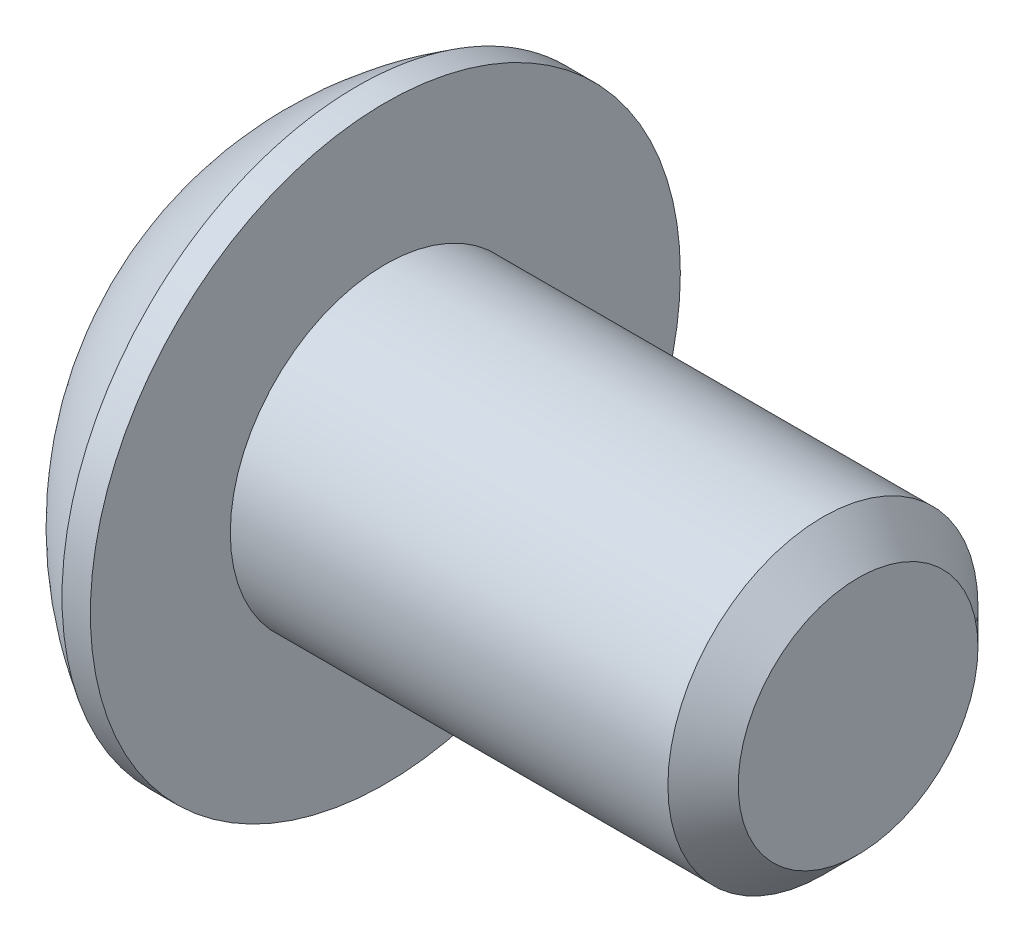
ISO-10303-21;
HEADER;
FILE_DESCRIPTION(('STEP AP214'),'2;1');
FILE_NAME('part.step','',(''),(''),'','','');
FILE_SCHEMA(('AUTOMOTIVE_DESIGN { 1 0 10303 214 1 1 1 1 }'));
ENDSEC;
DATA;
#1=APPLICATION_CONTEXT('core data for automotive mechanical design processes');
#2=APPLICATION_PROTOCOL_DEFINITION('international standard','automotive_design',2000,#1);
#3=PRODUCT_CONTEXT('',#1,'mechanical');
#4=PRODUCT('Part','Part','',(#3));
#5=PRODUCT_RELATED_PRODUCT_CATEGORY('part','',(#4));
#6=PRODUCT_DEFINITION_FORMATION('','',#4);
#7=PRODUCT_DEFINITION_CONTEXT('part definition',#1,'design');
#8=PRODUCT_DEFINITION('design','',#6,#7);
#9=PRODUCT_DEFINITION_SHAPE('','',#8);
#10=(LENGTH_UNIT() NAMED_UNIT(*) SI_UNIT(.MILLI.,.METRE.));
#11=(NAMED_UNIT(*) PLANE_ANGLE_UNIT() SI_UNIT($,.RADIAN.));
#12=(NAMED_UNIT(*) SI_UNIT($,.STERADIAN.) SOLID_ANGLE_UNIT());
#13=UNCERTAINTY_MEASURE_WITH_UNIT(LENGTH_MEASURE(1.E-05),#10,'distance_accuracy_value','');
#14=(GEOMETRIC_REPRESENTATION_CONTEXT(3) GLOBAL_UNCERTAINTY_ASSIGNED_CONTEXT((#13)) GLOBAL_UNIT_ASSIGNED_CONTEXT((#10,
#11,#12)) REPRESENTATION_CONTEXT('',''));
#15=CARTESIAN_POINT('',(0.,0.,0.));
#16=DIRECTION('',(0.,0.,1.));
#17=DIRECTION('',(1.,0.,0.));
#18=AXIS2_PLACEMENT_3D('',#15,#16,#17);
#19=CARTESIAN_POINT('',(1.32080000000034,0.,0.));
#20=DIRECTION('',(-1.,0.,0.));
#21=DIRECTION('',(0.,0.,-1.));
#22=AXIS2_PLACEMENT_3D('',#19,#20,#21);
#23=CONICAL_SURFACE('',#22,1.1937999999998,1.04719755119608);
#24=CARTESIAN_POINT('',(2.01004075135902,0.,-4.44089209850063E-13));
#25=VERTEX_POINT('',#24);
#26=VERTEX_LOOP('',#25);
#27=FACE_BOUND('',#26,.T.);
#28=CARTESIAN_POINT('',(1.32080000000009,0.,0.));
#29=DIRECTION('',(1.,0.,0.));
#30=DIRECTION('',(0.,0.,-1.));
#31=AXIS2_PLACEMENT_3D('',#28,#29,#30);
#32=CIRCLE('',#31,1.19380000000024);
#33=CARTESIAN_POINT('',(1.32080000000004,-1.03386112703797,-0.59690000000006));
#34=VERTEX_POINT('',#33);
#35=CARTESIAN_POINT('',(1.32080000000004,0.,-1.19380000000012));
#36=VERTEX_POINT('',#35);
#37=EDGE_CURVE('E37',#34,#36,#32,.T.);
#38=ORIENTED_EDGE('',*,*,#37,.F.);
#39=CARTESIAN_POINT('',(1.32080000000009,0.,0.));
#40=DIRECTION('',(1.,0.,0.));
#41=DIRECTION('',(0.,0.,-1.));
#42=AXIS2_PLACEMENT_3D('',#39,#40,#41);
#43=CIRCLE('',#42,1.19380000000024);
#44=CARTESIAN_POINT('',(1.32080000000004,-1.03386112703797,0.59690000000006));
#45=VERTEX_POINT('',#44);
#46=EDGE_CURVE('E127',#45,#34,#43,.T.);
#47=ORIENTED_EDGE('',*,*,#46,.F.);
#48=CARTESIAN_POINT('',(1.32080000000009,0.,0.));
#49=DIRECTION('',(1.,0.,0.));
#50=DIRECTION('',(0.,0.,-1.));
#51=AXIS2_PLACEMENT_3D('',#48,#49,#50);
#52=CIRCLE('',#51,1.19380000000024);
#53=CARTESIAN_POINT('',(1.32080000000004,1.49457637585666E-12,1.19380000000012));
#54=VERTEX_POINT('',#53);
#55=EDGE_CURVE('E133',#54,#45,#52,.T.);
#56=ORIENTED_EDGE('',*,*,#55,.F.);
#57=CARTESIAN_POINT('',(1.32080000000009,0.,0.));
#58=DIRECTION('',(1.,0.,0.));
#59=DIRECTION('',(0.,0.,-1.));
#60=AXIS2_PLACEMENT_3D('',#57,#58,#59);
#61=CIRCLE('',#60,1.19380000000024);
#62=CARTESIAN_POINT('',(1.32080000000004,1.03386112703797,0.596900000000061));
#63=VERTEX_POINT('',#62);
#64=EDGE_CURVE('E147',#63,#54,#61,.T.);
#65=ORIENTED_EDGE('',*,*,#64,.F.);
#66=CARTESIAN_POINT('',(1.32080000000009,0.,0.));
#67=DIRECTION('',(1.,0.,0.));
#68=DIRECTION('',(0.,0.,-1.));
#69=AXIS2_PLACEMENT_3D('',#66,#67,#68);
#70=CIRCLE('',#69,1.19380000000024);
#71=CARTESIAN_POINT('',(1.32080000000004,1.03386112703797,-0.596900000000061));
#72=VERTEX_POINT('',#71);
#73=EDGE_CURVE('E140',#72,#63,#70,.T.);
#74=ORIENTED_EDGE('',*,*,#73,.F.);
#75=CARTESIAN_POINT('',(1.32080000000009,0.,0.));
#76=DIRECTION('',(1.,0.,0.));
#77=DIRECTION('',(0.,0.,-1.));
#78=AXIS2_PLACEMENT_3D('',#75,#76,#77);
#79=CIRCLE('',#78,1.19380000000024);
#80=EDGE_CURVE('E137',#36,#72,#79,.T.);
#81=ORIENTED_EDGE('',*,*,#80,.F.);
#82=EDGE_LOOP('',(#38,#47,#56,#65,#74,#81));
#83=FACE_BOUND('',#82,.T.);
#84=ADVANCED_FACE('F34',(#27,#83),#23,.F.);
#85=CARTESIAN_POINT('',(1.3208,-2.06772225407572,1.1938));
#86=DIRECTION('',(1.,0.,0.));
#87=DIRECTION('',(0.,0.,1.));
#88=AXIS2_PLACEMENT_3D('',#85,#86,#87);
#89=PLANE('',#88);
#90=DIRECTION('',(0.,0.5,-0.866025403784439));
#91=VECTOR('',#90,1.);
#92=CARTESIAN_POINT('',(1.3208,-1.37848150271715,0.));
#93=LINE('',#92,#91);
#94=CARTESIAN_POINT('',(1.3208,-0.689240751358574,-1.1938));
#95=VERTEX_POINT('',#94);
#96=EDGE_CURVE('E109',#95,#34,#93,.F.);
#97=ORIENTED_EDGE('',*,*,#96,.T.);
#98=ORIENTED_EDGE('',*,*,#37,.T.);
#99=DIRECTION('',(0.,1.,0.));
#100=VECTOR('',#99,1.);
#101=CARTESIAN_POINT('',(1.3208,-0.689240751358574,-1.1938));
#102=LINE('',#101,#100);
#103=EDGE_CURVE('E124',#36,#95,#102,.F.);
#104=ORIENTED_EDGE('',*,*,#103,.T.);
#105=EDGE_LOOP('',(#97,#98,#104));
#106=FACE_BOUND('',#105,.T.);
#107=ADVANCED_FACE('F121',(#106),#89,.F.);
#108=CARTESIAN_POINT('',(1.3208,-2.06772225407572,1.1938));
#109=DIRECTION('',(1.,0.,0.));
#110=DIRECTION('',(0.,0.,1.));
#111=AXIS2_PLACEMENT_3D('',#108,#109,#110);
#112=PLANE('',#111);
#113=DIRECTION('',(0.,-0.5,-0.866025403784439));
#114=VECTOR('',#113,1.);
#115=CARTESIAN_POINT('',(1.3208,-0.689240751358574,1.1938));
#116=LINE('',#115,#114);
#117=CARTESIAN_POINT('',(1.3208,-1.37848150271715,0.));
#118=VERTEX_POINT('',#117);
#119=EDGE_CURVE('E129',#118,#45,#116,.F.);
#120=ORIENTED_EDGE('',*,*,#119,.T.);
#121=ORIENTED_EDGE('',*,*,#46,.T.);
#122=DIRECTION('',(0.,0.5,-0.866025403784439));
#123=VECTOR('',#122,1.);
#124=CARTESIAN_POINT('',(1.3208,-1.37848150271715,0.));
#125=LINE('',#124,#123);
#126=EDGE_CURVE('E104',#34,#118,#125,.F.);
#127=ORIENTED_EDGE('',*,*,#126,.T.);
#128=EDGE_LOOP('',(#120,#121,#127));
#129=FACE_BOUND('',#128,.T.);
#130=ADVANCED_FACE('F128',(#129),#112,.F.);
#131=CARTESIAN_POINT('',(1.3208,-2.06772225407572,1.1938));
#132=DIRECTION('',(1.,0.,0.));
#133=DIRECTION('',(0.,0.,1.));
#134=AXIS2_PLACEMENT_3D('',#131,#132,#133);
#135=PLANE('',#134);
#136=DIRECTION('',(0.,1.,0.));
#137=VECTOR('',#136,1.);
#138=CARTESIAN_POINT('',(1.3208,0.689240751358577,1.1938));
#139=LINE('',#138,#137);
#140=CARTESIAN_POINT('',(1.3208,-0.689240751358574,1.1938));
#141=VERTEX_POINT('',#140);
#142=EDGE_CURVE('E166',#141,#54,#139,.T.);
#143=ORIENTED_EDGE('',*,*,#142,.T.);
#144=ORIENTED_EDGE('',*,*,#55,.T.);
#145=DIRECTION('',(0.,-0.5,-0.866025403784439));
#146=VECTOR('',#145,1.);
#147=CARTESIAN_POINT('',(1.3208,-0.689240751358574,1.1938));
#148=LINE('',#147,#146);
#149=EDGE_CURVE('E164',#45,#141,#148,.F.);
#150=ORIENTED_EDGE('',*,*,#149,.T.);
#151=EDGE_LOOP('',(#143,#144,#150));
#152=FACE_BOUND('',#151,.T.);
#153=ADVANCED_FACE('F163',(#152),#135,.F.);
#154=CARTESIAN_POINT('',(1.3208,-2.06772225407572,1.1938));
#155=DIRECTION('',(1.,0.,0.));
#156=DIRECTION('',(0.,0.,1.));
#157=AXIS2_PLACEMENT_3D('',#154,#155,#156);
#158=PLANE('',#157);
#159=DIRECTION('',(0.,-0.5,0.866025403784439));
#160=VECTOR('',#159,1.);
#161=CARTESIAN_POINT('',(1.3208,1.37848150271715,0.));
#162=LINE('',#161,#160);
#163=CARTESIAN_POINT('',(1.3208,0.689240751358577,1.1938));
#164=VERTEX_POINT('',#163);
#165=EDGE_CURVE('E173',#164,#63,#162,.F.);
#166=ORIENTED_EDGE('',*,*,#165,.T.);
#167=ORIENTED_EDGE('',*,*,#64,.T.);
#168=DIRECTION('',(0.,1.,0.));
#169=VECTOR('',#168,1.);
#170=CARTESIAN_POINT('',(1.3208,0.689240751358577,1.1938));
#171=LINE('',#170,#169);
#172=EDGE_CURVE('E171',#54,#164,#171,.T.);
#173=ORIENTED_EDGE('',*,*,#172,.T.);
#174=EDGE_LOOP('',(#166,#167,#173));
#175=FACE_BOUND('',#174,.T.);
#176=ADVANCED_FACE('F170',(#175),#158,.F.);
#177=CARTESIAN_POINT('',(1.3208,-2.06772225407572,1.1938));
#178=DIRECTION('',(1.,0.,0.));
#179=DIRECTION('',(0.,0.,1.));
#180=AXIS2_PLACEMENT_3D('',#177,#178,#179);
#181=PLANE('',#180);
#182=DIRECTION('',(0.,0.5,0.866025403784439));
#183=VECTOR('',#182,1.);
#184=CARTESIAN_POINT('',(1.3208,0.689240751358576,-1.1938));
#185=LINE('',#184,#183);
#186=CARTESIAN_POINT('',(1.3208,1.37848150271715,0.));
#187=VERTEX_POINT('',#186);
#188=EDGE_CURVE('E184',#187,#72,#185,.F.);
#189=ORIENTED_EDGE('',*,*,#188,.T.);
#190=ORIENTED_EDGE('',*,*,#73,.T.);
#191=DIRECTION('',(0.,-0.5,0.866025403784439));
#192=VECTOR('',#191,1.);
#193=CARTESIAN_POINT('',(1.3208,1.37848150271715,0.));
#194=LINE('',#193,#192);
#195=EDGE_CURVE('E176',#63,#187,#194,.F.);
#196=ORIENTED_EDGE('',*,*,#195,.T.);
#197=EDGE_LOOP('',(#189,#190,#196));
#198=FACE_BOUND('',#197,.T.);
#199=ADVANCED_FACE('F182',(#198),#181,.F.);
#200=CARTESIAN_POINT('',(1.3208,-2.06772225407572,1.1938));
#201=DIRECTION('',(1.,0.,0.));
#202=DIRECTION('',(0.,0.,1.));
#203=AXIS2_PLACEMENT_3D('',#200,#201,#202);
#204=PLANE('',#203);
#205=DIRECTION('',(0.,1.,0.));
#206=VECTOR('',#205,1.);
#207=CARTESIAN_POINT('',(1.3208,-0.689240751358574,-1.1938));
#208=LINE('',#207,#206);
#209=CARTESIAN_POINT('',(1.3208,0.689240751358576,-1.1938));
#210=VERTEX_POINT('',#209);
#211=EDGE_CURVE('E144',#210,#36,#208,.F.);
#212=ORIENTED_EDGE('',*,*,#211,.T.);
#213=ORIENTED_EDGE('',*,*,#80,.T.);
#214=DIRECTION('',(0.,0.5,0.866025403784439));
#215=VECTOR('',#214,1.);
#216=CARTESIAN_POINT('',(1.3208,0.689240751358576,-1.1938));
#217=LINE('',#216,#215);
#218=EDGE_CURVE('E186',#72,#210,#217,.F.);
#219=ORIENTED_EDGE('',*,*,#218,.T.);
#220=EDGE_LOOP('',(#212,#213,#219));
#221=FACE_BOUND('',#220,.T.);
#222=ADVANCED_FACE('F307',(#221),#204,.F.);
#223=CARTESIAN_POINT('',(1.3208,-0.689240751358574,-1.1938));
#224=DIRECTION('',(0.,0.,1.));
#225=DIRECTION('',(0.,1.,0.));
#226=AXIS2_PLACEMENT_3D('',#223,#224,#225);
#227=PLANE('',#226);
#228=DIRECTION('',(0.,1.,0.));
#229=VECTOR('',#228,1.);
#230=CARTESIAN_POINT('',(0.,0.,-1.1938));
#231=LINE('',#230,#229);
#232=CARTESIAN_POINT('',(0.,0.689240751358577,-1.1938));
#233=VERTEX_POINT('',#232);
#234=CARTESIAN_POINT('',(0.,-0.689240751358574,-1.1938));
#235=VERTEX_POINT('',#234);
#236=EDGE_CURVE('E194',#233,#235,#231,.F.);
#237=ORIENTED_EDGE('',*,*,#236,.T.);
#238=DIRECTION('',(1.,0.,0.));
#239=VECTOR('',#238,1.);
#240=CARTESIAN_POINT('',(1.3208,-0.689240751358574,-1.1938));
#241=LINE('',#240,#239);
#242=EDGE_CURVE('E116',#235,#95,#241,.T.);
#243=ORIENTED_EDGE('',*,*,#242,.T.);
#244=ORIENTED_EDGE('',*,*,#103,.F.);
#245=ORIENTED_EDGE('',*,*,#211,.F.);
#246=DIRECTION('',(1.,0.,0.));
#247=VECTOR('',#246,1.);
#248=CARTESIAN_POINT('',(1.3208,0.689240751358576,-1.1938));
#249=LINE('',#248,#247);
#250=EDGE_CURVE('E189',#210,#233,#249,.F.);
#251=ORIENTED_EDGE('',*,*,#250,.T.);
#252=EDGE_LOOP('',(#237,#243,#244,#245,#251));
#253=FACE_BOUND('',#252,.T.);
#254=ADVANCED_FACE('F273',(#253),#227,.T.);
#255=CARTESIAN_POINT('',(1.3208,-1.37848150271715,0.));
#256=DIRECTION('',(0.,0.866025403784439,0.5));
#257=DIRECTION('',(0.,0.5,-0.866025403784439));
#258=AXIS2_PLACEMENT_3D('',#255,#256,#257);
#259=PLANE('',#258);
#260=DIRECTION('',(0.,-0.5,0.866025403784439));
#261=VECTOR('',#260,1.);
#262=CARTESIAN_POINT('',(0.,-0.689240751358574,-1.1938));
#263=LINE('',#262,#261);
#264=CARTESIAN_POINT('',(0.,-1.37848150271715,0.));
#265=VERTEX_POINT('',#264);
#266=EDGE_CURVE('E270',#235,#265,#263,.T.);
#267=ORIENTED_EDGE('',*,*,#266,.T.);
#268=DIRECTION('',(1.,0.,0.));
#269=VECTOR('',#268,1.);
#270=CARTESIAN_POINT('',(1.3208,-1.37848150271715,0.));
#271=LINE('',#270,#269);
#272=EDGE_CURVE('E111',#265,#118,#271,.T.);
#273=ORIENTED_EDGE('',*,*,#272,.T.);
#274=ORIENTED_EDGE('',*,*,#126,.F.);
#275=ORIENTED_EDGE('',*,*,#96,.F.);
#276=ORIENTED_EDGE('',*,*,#242,.F.);
#277=EDGE_LOOP('',(#267,#273,#274,#275,#276));
#278=FACE_BOUND('',#277,.T.);
#279=ADVANCED_FACE('F107',(#278),#259,.T.);
#280=CARTESIAN_POINT('',(1.3208,-0.689240751358574,1.1938));
#281=DIRECTION('',(0.,0.866025403784439,-0.5));
#282=DIRECTION('',(0.,-0.5,-0.866025403784439));
#283=AXIS2_PLACEMENT_3D('',#280,#281,#282);
#284=PLANE('',#283);
#285=DIRECTION('',(0.,0.5,0.866025403784439));
#286=VECTOR('',#285,1.);
#287=CARTESIAN_POINT('',(0.,-1.37848150271715,0.));
#288=LINE('',#287,#286);
#289=CARTESIAN_POINT('',(0.,-0.689240751358574,1.1938));
#290=VERTEX_POINT('',#289);
#291=EDGE_CURVE('E268',#265,#290,#288,.T.);
#292=ORIENTED_EDGE('',*,*,#291,.T.);
#293=DIRECTION('',(1.,0.,0.));
#294=VECTOR('',#293,1.);
#295=CARTESIAN_POINT('',(1.3208,-0.689240751358574,1.1938));
#296=LINE('',#295,#294);
#297=EDGE_CURVE('E177',#290,#141,#296,.T.);
#298=ORIENTED_EDGE('',*,*,#297,.T.);
#299=ORIENTED_EDGE('',*,*,#149,.F.);
#300=ORIENTED_EDGE('',*,*,#119,.F.);
#301=ORIENTED_EDGE('',*,*,#272,.F.);
#302=EDGE_LOOP('',(#292,#298,#299,#300,#301));
#303=FACE_BOUND('',#302,.T.);
#304=ADVANCED_FACE('F278',(#303),#284,.T.);
#305=CARTESIAN_POINT('',(1.3208,0.689240751358577,1.1938));
#306=DIRECTION('',(0.,0.,-1.));
#307=DIRECTION('',(1.,0.,0.));
#308=AXIS2_PLACEMENT_3D('',#305,#306,#307);
#309=PLANE('',#308);
#310=DIRECTION('',(0.,1.,0.));
#311=VECTOR('',#310,1.);
#312=CARTESIAN_POINT('',(0.,0.,1.1938));
#313=LINE('',#312,#311);
#314=CARTESIAN_POINT('',(0.,0.689240751358577,1.1938));
#315=VERTEX_POINT('',#314);
#316=EDGE_CURVE('E260',#290,#315,#313,.T.);
#317=ORIENTED_EDGE('',*,*,#316,.T.);
#318=DIRECTION('',(1.,0.,0.));
#319=VECTOR('',#318,1.);
#320=CARTESIAN_POINT('',(1.3208,0.689240751358577,1.1938));
#321=LINE('',#320,#319);
#322=EDGE_CURVE('E187',#315,#164,#321,.T.);
#323=ORIENTED_EDGE('',*,*,#322,.T.);
#324=ORIENTED_EDGE('',*,*,#172,.F.);
#325=ORIENTED_EDGE('',*,*,#142,.F.);
#326=ORIENTED_EDGE('',*,*,#297,.F.);
#327=EDGE_LOOP('',(#317,#323,#324,#325,#326));
#328=FACE_BOUND('',#327,.T.);
#329=ADVANCED_FACE('F280',(#328),#309,.T.);
#330=CARTESIAN_POINT('',(1.3208,1.37848150271715,0.));
#331=DIRECTION('',(0.,-0.866025403784439,-0.5));
#332=DIRECTION('',(0.,-0.5,0.866025403784439));
#333=AXIS2_PLACEMENT_3D('',#330,#331,#332);
#334=PLANE('',#333);
#335=DIRECTION('',(0.,0.5,-0.866025403784439));
#336=VECTOR('',#335,1.);
#337=CARTESIAN_POINT('',(0.,0.689240751358577,1.1938));
#338=LINE('',#337,#336);
#339=CARTESIAN_POINT('',(0.,1.37848150271715,0.));
#340=VERTEX_POINT('',#339);
#341=EDGE_CURVE('E257',#315,#340,#338,.T.);
#342=ORIENTED_EDGE('',*,*,#341,.T.);
#343=DIRECTION('',(1.,0.,0.));
#344=VECTOR('',#343,1.);
#345=CARTESIAN_POINT('',(1.3208,1.37848150271715,0.));
#346=LINE('',#345,#344);
#347=EDGE_CURVE('E202',#340,#187,#346,.T.);
#348=ORIENTED_EDGE('',*,*,#347,.T.);
#349=ORIENTED_EDGE('',*,*,#195,.F.);
#350=ORIENTED_EDGE('',*,*,#165,.F.);
#351=ORIENTED_EDGE('',*,*,#322,.F.);
#352=EDGE_LOOP('',(#342,#348,#349,#350,#351));
#353=FACE_BOUND('',#352,.T.);
#354=ADVANCED_FACE('F281',(#353),#334,.T.);
#355=CARTESIAN_POINT('',(1.3208,0.689240751358576,-1.1938));
#356=DIRECTION('',(0.,-0.866025403784439,0.5));
#357=DIRECTION('',(0.,0.5,0.866025403784439));
#358=AXIS2_PLACEMENT_3D('',#355,#356,#357);
#359=PLANE('',#358);
#360=DIRECTION('',(0.,-0.5,-0.866025403784439));
#361=VECTOR('',#360,1.);
#362=CARTESIAN_POINT('',(0.,1.37848150271715,0.));
#363=LINE('',#362,#361);
#364=EDGE_CURVE('E52',#340,#233,#363,.T.);
#365=ORIENTED_EDGE('',*,*,#364,.T.);
#366=ORIENTED_EDGE('',*,*,#250,.F.);
#367=ORIENTED_EDGE('',*,*,#218,.F.);
#368=ORIENTED_EDGE('',*,*,#188,.F.);
#369=ORIENTED_EDGE('',*,*,#347,.F.);
#370=EDGE_LOOP('',(#365,#366,#367,#368,#369));
#371=FACE_BOUND('',#370,.T.);
#372=ADVANCED_FACE('F282',(#371),#359,.T.);
#373=CARTESIAN_POINT('',(0.,0.,0.));
#374=DIRECTION('',(-1.,0.,0.));
#375=DIRECTION('',(0.,0.,-1.));
#376=AXIS2_PLACEMENT_3D('',#373,#374,#375);
#377=PLANE('',#376);
#378=ORIENTED_EDGE('',*,*,#341,.F.);
#379=ORIENTED_EDGE('',*,*,#316,.F.);
#380=ORIENTED_EDGE('',*,*,#291,.F.);
#381=ORIENTED_EDGE('',*,*,#266,.F.);
#382=ORIENTED_EDGE('',*,*,#236,.F.);
#383=ORIENTED_EDGE('',*,*,#364,.F.);
#384=EDGE_LOOP('',(#378,#379,#380,#381,#382,#383));
#385=FACE_BOUND('',#384,.T.);
#386=CARTESIAN_POINT('',(0.,1.9812,0.));
#387=CARTESIAN_POINT('',(0.,1.9811996664299,-0.0556258831179428));
#388=CARTESIAN_POINT('',(0.,1.97885520380442,-0.111261989398606));
#389=CARTESIAN_POINT('',(0.,1.96949260169541,-0.222149719830458));
#390=CARTESIAN_POINT('',(0.,1.96247308239605,-0.277401225602895));
#391=CARTESIAN_POINT('',(0.,1.94379192841038,-0.387209508139747));
#392=CARTESIAN_POINT('',(-1.85325793235264E-13,1.93212292489526,-0.441765039546365));
#393=CARTESIAN_POINT('',(1.86344214223505E-13,1.90422331175315,-0.549729449347493));
#394=CARTESIAN_POINT('',(6.94543371897454E-13,1.88798900035338,-0.603137359208869));
#395=CARTESIAN_POINT('',(1.15501975216981E-12,1.83266214476501,-0.760839131321828));
#396=CARTESIAN_POINT('',(0.,1.78690023648845,-0.862876433575429));
#397=CARTESIAN_POINT('',(0.,1.67887358150667,-1.05780719540872));
#398=CARTESIAN_POINT('',(9.54193214892627E-13,1.6166082074585,-1.15070030720801));
#399=CARTESIAN_POINT('',(5.94805591894675E-13,1.51224157140982,-1.28116890915697));
#400=CARTESIAN_POINT('',(1.63221293851378E-13,1.4755970394354,-1.32320451127026));
#401=CARTESIAN_POINT('',(-1.62196980336157E-13,1.39893832619713,-1.40400288695709));
#402=CARTESIAN_POINT('',(0.,1.35892742784698,-1.44276877695455));
#403=CARTESIAN_POINT('',(1.14362537325405E-13,1.23416504602197,-1.55382272417904));
#404=CARTESIAN_POINT('',(0.,1.14466125559859,-1.62089527952111));
#405=CARTESIAN_POINT('',(0.,0.955712144178167,-1.7390221808118));
#406=CARTESIAN_POINT('',(0.,0.856267198233564,-1.79007713076007));
#407=CARTESIAN_POINT('',(0.,0.650206345910843,-1.87477637530954));
#408=CARTESIAN_POINT('',(0.,0.543590516134855,-1.90842085586267));
#409=CARTESIAN_POINT('',(0.,0.326226155292018,-1.95733039300656));
#410=CARTESIAN_POINT('',(0.,0.21547760215793,-1.97259535144288));
#411=CARTESIAN_POINT('',(0.,-0.00701040587544633,-1.98431697865418));
#412=CARTESIAN_POINT('',(0.,-0.118749860774734,-1.98077364742917));
#413=CARTESIAN_POINT('',(0.,-0.340050178355485,-1.95497485623825));
#414=CARTESIAN_POINT('',(0.,-0.449611052668256,-1.93271949620218));
#415=CARTESIAN_POINT('',(0.,-0.663431110729174,-1.87014138774524));
#416=CARTESIAN_POINT('',(0.,-0.76769023783852,-1.82981844635272));
#417=CARTESIAN_POINT('',(0.,-0.968005760719347,-1.73219968377096));
#418=CARTESIAN_POINT('',(0.,-1.0640618469811,-1.6749032225164));
#419=CARTESIAN_POINT('',(0.,-1.19980276751283,-1.57757371205873));
#420=CARTESIAN_POINT('',(0.,-1.24366557129213,-1.54322665019466));
#421=CARTESIAN_POINT('',(0.,-1.32838995706696,-1.47093063174264));
#422=CARTESIAN_POINT('',(0.,-1.36924860178706,-1.43297823102439));
#423=CARTESIAN_POINT('',(0.,-1.48674671849223,-1.31419842051173));
#424=CARTESIAN_POINT('',(0.,-1.55842832343237,-1.22836221289311));
#425=CARTESIAN_POINT('',(0.,-1.6863396856475,-1.04586168272493));
#426=CARTESIAN_POINT('',(0.,-1.7425700302488,-0.949197771949775));
#427=CARTESIAN_POINT('',(0.,-1.8141614250401,-0.798182600298684));
#428=CARTESIAN_POINT('',(0.,-1.83591780585875,-0.74677620384779));
#429=CARTESIAN_POINT('',(0.,-1.87500754181092,-0.642341081688635));
#430=CARTESIAN_POINT('',(0.,-1.89234447645404,-0.589313708122846));
#431=CARTESIAN_POINT('',(0.,-1.92246053433555,-0.482076273028395));
#432=CARTESIAN_POINT('',(0.,-1.93524685475118,-0.42786822425751));
#433=CARTESIAN_POINT('',(0.,-1.95620937250494,-0.318578151844611));
#434=CARTESIAN_POINT('',(0.,-1.96438692958147,-0.263496390912872));
#435=CARTESIAN_POINT('',(0.,-1.97388528284653,-0.173607715038558));
#436=CARTESIAN_POINT('',(0.,-1.97662743364426,-0.138944718024998));
#437=CARTESIAN_POINT('',(0.,-1.98028489645283,-0.0695224782567002));
#438=CARTESIAN_POINT('',(0.,-1.98120020846367,-0.0347632355019631));
#439=CARTESIAN_POINT('',(0.,-1.9811996664299,0.0556258831179437));
#440=CARTESIAN_POINT('',(0.,-1.97885520380442,0.111261989398607));
#441=CARTESIAN_POINT('',(0.,-1.96949260169541,0.222149719830459));
#442=CARTESIAN_POINT('',(0.,-1.96247308239606,0.277401225602897));
#443=CARTESIAN_POINT('',(0.,-1.94379192841039,0.38720950813975));
#444=CARTESIAN_POINT('',(-1.85269749640692E-13,-1.93212292489526,0.441765039546367));
#445=CARTESIAN_POINT('',(1.86288125054388E-13,-1.90422331175315,0.549729449347495));
#446=CARTESIAN_POINT('',(6.94525090263764E-13,-1.88798900035338,0.603137359208872));
#447=CARTESIAN_POINT('',(1.15505622829081E-12,-1.83266214476501,0.760839131321831));
#448=CARTESIAN_POINT('',(0.,-1.78690023648845,0.862876433575431));
#449=CARTESIAN_POINT('',(0.,-1.67887358150667,1.05780719540872));
#450=CARTESIAN_POINT('',(9.5424881286938E-13,-1.6166082074585,1.15070030720801));
#451=CARTESIAN_POINT('',(5.94777756479239E-13,-1.51224157140982,1.28116890915698));
#452=CARTESIAN_POINT('',(1.63138949183833E-13,-1.47559703943539,1.32320451127027));
#453=CARTESIAN_POINT('',(-1.62114715061273E-13,-1.39893832619713,1.40400288695709));
#454=CARTESIAN_POINT('',(0.,-1.35892742784699,1.44276877695455));
#455=CARTESIAN_POINT('',(1.13760489124207E-13,-1.23416504602197,1.55382272417904));
#456=CARTESIAN_POINT('',(0.,-1.14466125559859,1.62089527952111));
#457=CARTESIAN_POINT('',(0.,-0.95571214417816,1.73902218081179));
#458=CARTESIAN_POINT('',(0.,-0.856267198233559,1.79007713076007));
#459=CARTESIAN_POINT('',(0.,-0.65020634591084,1.87477637530954));
#460=CARTESIAN_POINT('',(0.,-0.543590516134854,1.90842085586267));
#461=CARTESIAN_POINT('',(0.,-0.326226155292018,1.95733039300657));
#462=CARTESIAN_POINT('',(0.,-0.215477602157929,1.97259535144288));
#463=CARTESIAN_POINT('',(0.,0.00701040587544865,1.98431697865418));
#464=CARTESIAN_POINT('',(0.,0.118749860774737,1.98077364742916));
#465=CARTESIAN_POINT('',(0.,0.340050178355489,1.95497485623824));
#466=CARTESIAN_POINT('',(0.,0.44961105266826,1.93271949620218));
#467=CARTESIAN_POINT('',(0.,0.663431110729178,1.87014138774524));
#468=CARTESIAN_POINT('',(0.,0.767690237838524,1.82981844635272));
#469=CARTESIAN_POINT('',(0.,0.968005760719347,1.73219968377096));
#470=CARTESIAN_POINT('',(0.,1.0640618469811,1.67490322251639));
#471=CARTESIAN_POINT('',(0.,1.19980276751283,1.57757371205873));
#472=CARTESIAN_POINT('',(0.,1.24366557129214,1.54322665019465));
#473=CARTESIAN_POINT('',(0.,1.32838995706696,1.47093063174263));
#474=CARTESIAN_POINT('',(0.,1.36924860178706,1.43297823102439));
#475=CARTESIAN_POINT('',(0.,1.48674671849223,1.31419842051172));
#476=CARTESIAN_POINT('',(0.,1.55842832343237,1.22836221289311));
#477=CARTESIAN_POINT('',(0.,1.6863396856475,1.04586168272492));
#478=CARTESIAN_POINT('',(0.,1.7425700302488,0.949197771949768));
#479=CARTESIAN_POINT('',(0.,1.8141614250401,0.798182600298677));
#480=CARTESIAN_POINT('',(0.,1.83591780585875,0.746776203847785));
#481=CARTESIAN_POINT('',(0.,1.87500754181092,0.64234108168863));
#482=CARTESIAN_POINT('',(0.,1.89234447645404,0.589313708122841));
#483=CARTESIAN_POINT('',(0.,1.92246053433555,0.482076273028389));
#484=CARTESIAN_POINT('',(0.,1.93524685475118,0.427868224257504));
#485=CARTESIAN_POINT('',(0.,1.95620937250494,0.318578151844605));
#486=CARTESIAN_POINT('',(0.,1.96438692958147,0.263496390912866));
#487=CARTESIAN_POINT('',(0.,1.97388528284653,0.173607715038553));
#488=CARTESIAN_POINT('',(0.,1.97662743364426,0.138944718024994));
#489=CARTESIAN_POINT('',(0.,1.98028489645283,0.0695224782566989));
#490=CARTESIAN_POINT('',(0.,1.98120020846367,0.034763235501963));
#491=CARTESIAN_POINT('',(0.,1.9812,0.));
#492=B_SPLINE_CURVE_WITH_KNOTS('',3,(#386,#387,#388,#389,#390,#391,#392,#393,#394,#395,#396,
#397,#398,#399,#400,#401,#402,#403,#404,#405,#406,#407,#408,#409,#410,#411,#412,#413,#414,#415,
#416,#417,#418,#419,#420,#421,#422,#423,#424,#425,#426,#427,#428,#429,#430,#431,#432,#433,#434,
#435,#436,#437,#438,#439,#440,#441,#442,#443,#444,#445,#446,#447,#448,#449,#450,#451,#452,#453,
#454,#455,#456,#457,#458,#459,#460,#461,#462,#463,#464,#465,#466,#467,#468,#469,#470,#471,#472,
#473,#474,#475,#476,#477,#478,#479,#480,#481,#482,#483,#484,#485,#486,#487,#488,#489,#490,#491),
.UNSPECIFIED.,.T.,.F.,(4,2,2,2,2,2,2,2,2,2,2,2,2,2,2,2,2,2,2,2,2,2,2,2,2,2,2,2,2,2,2,2,2,2,2,2,
2,2,2,2,2,2,2,2,2,2,2,2,2,2,2,2,4),(0.,0.166845646007828,0.333740557374255,0.500901034367693,
0.668197445942386,1.00199278686282,1.33580081809885,1.50292354032982,1.6698851310853,
2.00370118900129,2.33750465770544,2.67130456115909,3.00510624723801,3.33890793331696,
3.67270783677065,4.00651130547476,4.34032736339026,4.50728895414554,4.67441167637632,
5.00821970761259,5.34201504853332,5.50931146010827,5.67647193710191,5.84336684846844,
6.0102124944764,6.11448220058334,6.21875190669029,6.38559755269812,6.55249246406454,
6.71965294105798,6.88694935263268,7.22074469355311,7.55455272478915,7.72167544702011,
7.88863703777559,8.22245309569158,8.55625656439573,8.89005646784938,9.2238581539283,
9.55765984000725,9.89145974346094,10.2252632121651,10.5590792700806,10.7260408608358,
10.8931635830666,11.2269716143029,11.5607669552236,11.7280633667986,11.8952238437922,
12.0621187551587,12.2289644011667,12.3332341072736,12.4375038133806),.UNSPECIFIED.);
#493=CARTESIAN_POINT('',(0.,1.9812,0.));
#494=VERTEX_POINT('',#493);
#495=EDGE_CURVE('E150',#494,#494,#492,.T.);
#496=ORIENTED_EDGE('',*,*,#495,.T.);
#497=EDGE_LOOP('',(#496));
#498=FACE_BOUND('',#497,.T.);
#499=ADVANCED_FACE('F275',(#385,#498),#377,.T.);
#500=CARTESIAN_POINT('',(4.13385,0.,0.));
#501=DIRECTION('',(0.,1.,0.));
#502=DIRECTION('',(1.,0.,0.));
#503=AXIS2_PLACEMENT_3D('',#500,#501,#502);
#504=SPHERICAL_SURFACE('',#503,4.58408870578439);
#505=CARTESIAN_POINT('',(1.8288,0.,0.));
#506=DIRECTION('',(1.,0.,0.));
#507=DIRECTION('',(0.,0.,-1.));
#508=AXIS2_PLACEMENT_3D('',#505,#506,#507);
#509=CIRCLE('',#508,3.9624);
#510=CARTESIAN_POINT('',(1.8288,0.,-3.9624));
#511=VERTEX_POINT('',#510);
#512=EDGE_CURVE('E250',#511,#511,#509,.F.);
#513=ORIENTED_EDGE('',*,*,#512,.T.);
#514=EDGE_LOOP('',(#513));
#515=FACE_BOUND('',#514,.T.);
#516=ORIENTED_EDGE('',*,*,#495,.F.);
#517=EDGE_LOOP('',(#516));
#518=FACE_BOUND('',#517,.T.);
#519=ADVANCED_FACE('F289',(#515,#518),#504,.T.);
#520=CARTESIAN_POINT('',(8.5598,0.,0.));
#521=DIRECTION('',(-1.,0.,0.));
#522=DIRECTION('',(0.,0.,-1.));
#523=AXIS2_PLACEMENT_3D('',#520,#521,#522);
#524=PLANE('',#523);
#525=CARTESIAN_POINT('',(8.55979999994361,0.,0.));
#526=DIRECTION('',(1.,0.,0.));
#527=DIRECTION('',(0.,0.,-1.));
#528=AXIS2_PLACEMENT_3D('',#525,#526,#527);
#529=CIRCLE('',#528,1.61036000002923);
#530=CARTESIAN_POINT('',(8.55979999994361,0.,-1.61036000002923));
#531=VERTEX_POINT('',#530);
#532=EDGE_CURVE('E248',#531,#531,#529,.T.);
#533=ORIENTED_EDGE('',*,*,#532,.T.);
#534=EDGE_LOOP('',(#533));
#535=FACE_BOUND('',#534,.T.);
#536=ADVANCED_FACE('F346',(#535),#524,.F.);
#537=CARTESIAN_POINT('',(0.,0.,0.));
#538=DIRECTION('',(-1.,0.,0.));
#539=DIRECTION('',(0.,0.,-1.));
#540=AXIS2_PLACEMENT_3D('',#537,#538,#539);
#541=CYLINDRICAL_SURFACE('',#540,3.9624);
#542=ORIENTED_EDGE('',*,*,#512,.F.);
#543=EDGE_LOOP('',(#542));
#544=FACE_BOUND('',#543,.T.);
#545=CARTESIAN_POINT('',(2.2098,0.,0.));
#546=DIRECTION('',(1.,0.,0.));
#547=DIRECTION('',(0.,0.,-1.));
#548=AXIS2_PLACEMENT_3D('',#545,#546,#547);
#549=CIRCLE('',#548,3.9624);
#550=CARTESIAN_POINT('',(2.2098,0.,-3.9624));
#551=VERTEX_POINT('',#550);
#552=EDGE_CURVE('E245',#551,#551,#549,.T.);
#553=ORIENTED_EDGE('',*,*,#552,.F.);
#554=EDGE_LOOP('',(#553));
#555=FACE_BOUND('',#554,.T.);
#556=ADVANCED_FACE('F354',(#544,#555),#541,.T.);
#557=CARTESIAN_POINT('',(8.0873599999336,0.,0.));
#558=DIRECTION('',(-1.,0.,0.));
#559=DIRECTION('',(0.,0.,-1.));
#560=AXIS2_PLACEMENT_3D('',#557,#558,#559);
#561=CONICAL_SURFACE('',#560,2.08280000003924,0.785398163397448);
#562=CARTESIAN_POINT('',(8.08736,0.,0.));
#563=DIRECTION('',(1.,0.,0.));
#564=DIRECTION('',(0.,0.,-1.));
#565=AXIS2_PLACEMENT_3D('',#562,#563,#564);
#566=CIRCLE('',#565,2.0828);
#567=CARTESIAN_POINT('',(8.08736,0.,-2.0828));
#568=VERTEX_POINT('',#567);
#569=EDGE_CURVE('E43',#568,#568,#566,.T.);
#570=ORIENTED_EDGE('',*,*,#569,.T.);
#571=EDGE_LOOP('',(#570));
#572=FACE_BOUND('',#571,.T.);
#573=ORIENTED_EDGE('',*,*,#532,.F.);
#574=EDGE_LOOP('',(#573));
#575=FACE_BOUND('',#574,.T.);
#576=ADVANCED_FACE('F364',(#572,#575),#561,.T.);
#577=CARTESIAN_POINT('',(2.2098,2.0828,0.));
#578=DIRECTION('',(-1.,0.,0.));
#579=DIRECTION('',(0.,0.,-1.));
#580=AXIS2_PLACEMENT_3D('',#577,#578,#579);
#581=PLANE('',#580);
#582=CARTESIAN_POINT('',(2.2098,0.,0.));
#583=DIRECTION('',(1.,0.,0.));
#584=DIRECTION('',(0.,0.,-1.));
#585=AXIS2_PLACEMENT_3D('',#582,#583,#584);
#586=CIRCLE('',#585,2.0828);
#587=CARTESIAN_POINT('',(2.2098,0.,-2.0828));
#588=VERTEX_POINT('',#587);
#589=EDGE_CURVE('E11',#588,#588,#586,.F.);
#590=ORIENTED_EDGE('',*,*,#589,.T.);
#591=EDGE_LOOP('',(#590));
#592=FACE_BOUND('',#591,.T.);
#593=ORIENTED_EDGE('',*,*,#552,.T.);
#594=EDGE_LOOP('',(#593));
#595=FACE_BOUND('',#594,.T.);
#596=ADVANCED_FACE('F374',(#592,#595),#581,.F.);
#597=CARTESIAN_POINT('',(0.,0.,0.));
#598=DIRECTION('',(-1.,0.,0.));
#599=DIRECTION('',(0.,0.,-1.));
#600=AXIS2_PLACEMENT_3D('',#597,#598,#599);
#601=CYLINDRICAL_SURFACE('',#600,2.0828);
#602=ORIENTED_EDGE('',*,*,#589,.F.);
#603=EDGE_LOOP('',(#602));
#604=FACE_BOUND('',#603,.T.);
#605=ORIENTED_EDGE('',*,*,#569,.F.);
#606=EDGE_LOOP('',(#605));
#607=FACE_BOUND('',#606,.T.);
#608=ADVANCED_FACE('F384',(#604,#607),#601,.T.);
#609=CLOSED_SHELL('',(#84,#107,#130,#153,#176,#199,#222,#254,#279,#304,#329,#354,#372,#499,#519,
#536,#556,#576,#596,#608));
#610=MANIFOLD_SOLID_BREP('B2',#609);
#611=ADVANCED_BREP_SHAPE_REPRESENTATION('',(#18,#610),#14);
#612=SHAPE_DEFINITION_REPRESENTATION(#9,#611);
ENDSEC;
END-ISO-10303-21;
